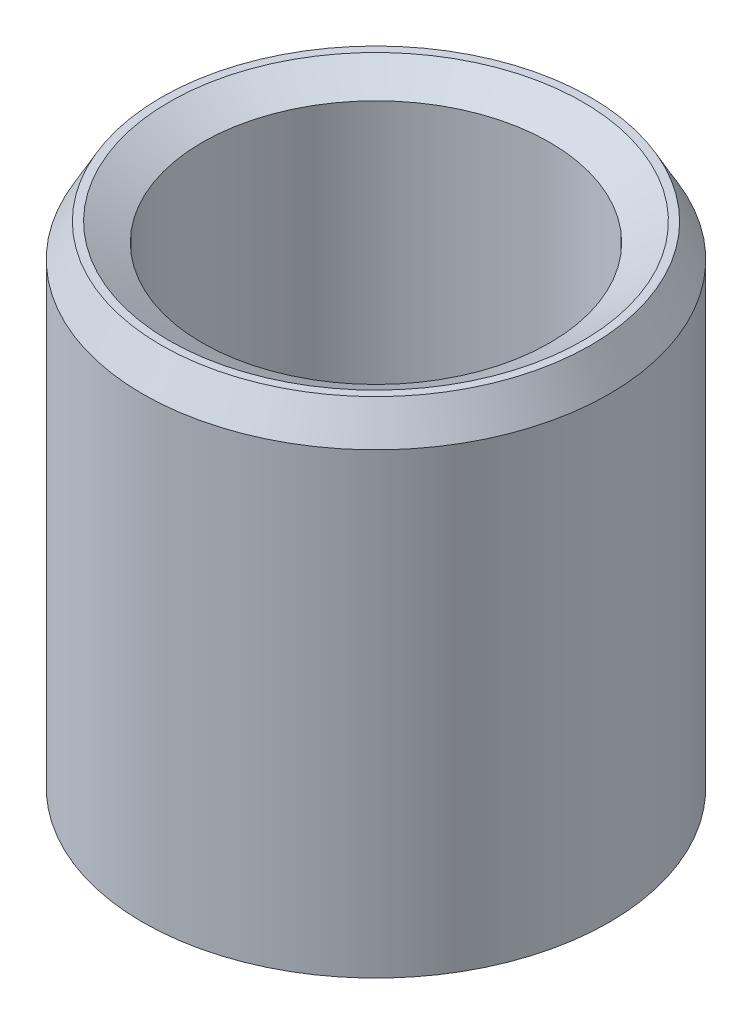
ISO-10303-21;
HEADER;
FILE_DESCRIPTION(('STEP AP214'),'2;1');
FILE_NAME('part.step','',(''),(''),'','','');
FILE_SCHEMA(('AUTOMOTIVE_DESIGN { 1 0 10303 214 1 1 1 1 }'));
ENDSEC;
DATA;
#1=APPLICATION_CONTEXT('core data for automotive mechanical design processes');
#2=APPLICATION_PROTOCOL_DEFINITION('international standard','automotive_design',2000,#1);
#3=PRODUCT_CONTEXT('',#1,'mechanical');
#4=PRODUCT('Part','Part','',(#3));
#5=PRODUCT_RELATED_PRODUCT_CATEGORY('part','',(#4));
#6=PRODUCT_DEFINITION_FORMATION('','',#4);
#7=PRODUCT_DEFINITION_CONTEXT('part definition',#1,'design');
#8=PRODUCT_DEFINITION('design','',#6,#7);
#9=PRODUCT_DEFINITION_SHAPE('','',#8);
#10=(LENGTH_UNIT() NAMED_UNIT(*) SI_UNIT(.MILLI.,.METRE.));
#11=(NAMED_UNIT(*) PLANE_ANGLE_UNIT() SI_UNIT($,.RADIAN.));
#12=(NAMED_UNIT(*) SI_UNIT($,.STERADIAN.) SOLID_ANGLE_UNIT());
#13=UNCERTAINTY_MEASURE_WITH_UNIT(LENGTH_MEASURE(1.E-05),#10,'distance_accuracy_value','');
#14=(GEOMETRIC_REPRESENTATION_CONTEXT(3) GLOBAL_UNCERTAINTY_ASSIGNED_CONTEXT((#13)) GLOBAL_UNIT_ASSIGNED_CONTEXT((#10,
#11,#12)) REPRESENTATION_CONTEXT('',''));
#15=CARTESIAN_POINT('',(0.,0.,0.));
#16=DIRECTION('',(0.,0.,1.));
#17=DIRECTION('',(1.,0.,0.));
#18=AXIS2_PLACEMENT_3D('',#15,#16,#17);
#19=CARTESIAN_POINT('',(0.,49.1159949794759,0.));
#20=DIRECTION('',(0.,-1.,0.));
#21=DIRECTION('',(0.,0.,-1.));
#22=AXIS2_PLACEMENT_3D('',#19,#20,#21);
#23=CYLINDRICAL_SURFACE('',#22,22.5);
#24=CARTESIAN_POINT('',(0.,1.78092800597696,0.));
#25=DIRECTION('',(0.,1.,0.));
#26=DIRECTION('',(0.,0.,1.));
#27=AXIS2_PLACEMENT_3D('',#24,#25,#26);
#28=CIRCLE('',#27,22.5);
#29=CARTESIAN_POINT('',(0.,1.78092800597696,-22.5));
#30=VERTEX_POINT('',#29);
#31=EDGE_CURVE('E10',#30,#30,#28,.T.);
#32=CARTESIAN_POINT('',(0.,45.9272247692056,0.));
#33=DIRECTION('',(0.,1.,0.));
#34=DIRECTION('',(0.,0.,1.));
#35=AXIS2_PLACEMENT_3D('',#32,#33,#34);
#36=CIRCLE('',#35,22.5);
#37=CARTESIAN_POINT('',(0.,45.9272247692056,-22.5));
#38=VERTEX_POINT('',#37);
#39=EDGE_CURVE('E50',#38,#38,#36,.F.);
#40=CARTESIAN_POINT('',(0.,1.78092800597696,-22.5));
#41=CARTESIAN_POINT('',(0.,2.24078526392725,-22.5));
#42=CARTESIAN_POINT('',(0.,2.70064252187755,-22.5));
#43=CARTESIAN_POINT('',(0.,3.62035703777815,-22.5));
#44=CARTESIAN_POINT('',(0.,4.08021429572845,-22.5));
#45=CARTESIAN_POINT('',(0.,4.99992881162905,-22.5));
#46=CARTESIAN_POINT('',(0.,5.45978606957935,-22.5));
#47=CARTESIAN_POINT('',(0.,6.37950058547994,-22.5));
#48=CARTESIAN_POINT('',(0.,6.83935784343024,-22.5));
#49=CARTESIAN_POINT('',(0.,7.75907235933084,-22.5));
#50=CARTESIAN_POINT('',(0.,8.21892961728114,-22.5));
#51=CARTESIAN_POINT('',(0.,9.13864413318174,-22.5));
#52=CARTESIAN_POINT('',(0.,9.59850139113203,-22.5));
#53=CARTESIAN_POINT('',(0.,10.5182159070326,-22.5));
#54=CARTESIAN_POINT('',(0.,10.9780731649829,-22.5));
#55=CARTESIAN_POINT('',(0.,11.8977876808835,-22.5));
#56=CARTESIAN_POINT('',(0.,12.3576449388338,-22.5));
#57=CARTESIAN_POINT('',(0.,13.2773594547344,-22.5));
#58=CARTESIAN_POINT('',(0.,13.7372167126847,-22.5));
#59=CARTESIAN_POINT('',(0.,14.6569312285853,-22.5));
#60=CARTESIAN_POINT('',(0.,15.1167884865356,-22.5));
#61=CARTESIAN_POINT('',(0.,16.0365030024362,-22.5));
#62=CARTESIAN_POINT('',(0.,16.4963602603865,-22.5));
#63=CARTESIAN_POINT('',(0.,17.4160747762871,-22.5));
#64=CARTESIAN_POINT('',(0.,17.8759320342374,-22.5));
#65=CARTESIAN_POINT('',(0.,18.795646550138,-22.5));
#66=CARTESIAN_POINT('',(0.,19.2555038080883,-22.5));
#67=CARTESIAN_POINT('',(0.,20.1752183239889,-22.5));
#68=CARTESIAN_POINT('',(0.,20.6350755819392,-22.5));
#69=CARTESIAN_POINT('',(0.,21.5547900978398,-22.5));
#70=CARTESIAN_POINT('',(0.,22.0146473557901,-22.5));
#71=CARTESIAN_POINT('',(0.,22.9343618716907,-22.5));
#72=CARTESIAN_POINT('',(0.,23.394219129641,-22.5));
#73=CARTESIAN_POINT('',(0.,24.3139336455416,-22.5));
#74=CARTESIAN_POINT('',(0.,24.7737909034919,-22.5));
#75=CARTESIAN_POINT('',(0.,25.6935054193925,-22.5));
#76=CARTESIAN_POINT('',(0.,26.1533626773428,-22.5));
#77=CARTESIAN_POINT('',(0.,27.0730771932434,-22.5));
#78=CARTESIAN_POINT('',(0.,27.5329344511937,-22.5));
#79=CARTESIAN_POINT('',(0.,28.4526489670943,-22.5));
#80=CARTESIAN_POINT('',(0.,28.9125062250446,-22.5));
#81=CARTESIAN_POINT('',(0.,29.8322207409452,-22.5));
#82=CARTESIAN_POINT('',(0.,30.2920779988955,-22.5));
#83=CARTESIAN_POINT('',(0.,31.2117925147961,-22.5));
#84=CARTESIAN_POINT('',(0.,31.6716497727464,-22.5));
#85=CARTESIAN_POINT('',(0.,32.591364288647,-22.5));
#86=CARTESIAN_POINT('',(0.,33.0512215465973,-22.5));
#87=CARTESIAN_POINT('',(0.,33.9709360624979,-22.5));
#88=CARTESIAN_POINT('',(0.,34.4307933204482,-22.5));
#89=CARTESIAN_POINT('',(0.,35.3505078363488,-22.5));
#90=CARTESIAN_POINT('',(0.,35.8103650942991,-22.5));
#91=CARTESIAN_POINT('',(0.,36.7300796101997,-22.5));
#92=CARTESIAN_POINT('',(0.,37.18993686815,-22.5));
#93=CARTESIAN_POINT('',(0.,38.1096513840506,-22.5));
#94=CARTESIAN_POINT('',(0.,38.5695086420008,-22.5));
#95=CARTESIAN_POINT('',(0.,39.4892231579014,-22.5));
#96=CARTESIAN_POINT('',(0.,39.9490804158517,-22.5));
#97=CARTESIAN_POINT('',(0.,40.8687949317523,-22.5));
#98=CARTESIAN_POINT('',(0.,41.3286521897026,-22.5));
#99=CARTESIAN_POINT('',(0.,42.2483667056032,-22.5));
#100=CARTESIAN_POINT('',(0.,42.7082239635535,-22.5));
#101=CARTESIAN_POINT('',(0.,43.6279384794541,-22.5));
#102=CARTESIAN_POINT('',(0.,44.0877957374044,-22.5));
#103=CARTESIAN_POINT('',(0.,45.007510253305,-22.5));
#104=CARTESIAN_POINT('',(0.,45.4673675112553,-22.5));
#105=CARTESIAN_POINT('',(0.,45.9272247692056,-22.5));
#106=B_SPLINE_CURVE_WITH_KNOTS('',3,(#40,#41,#42,#43,#44,#45,#46,#47,#48,#49,#50,#51,#52,#53,
#54,#55,#56,#57,#58,#59,#60,#61,#62,#63,#64,#65,#66,#67,#68,#69,#70,#71,#72,#73,#74,#75,#76,#77,
#78,#79,#80,#81,#82,#83,#84,#85,#86,#87,#88,#89,#90,#91,#92,#93,#94,#95,#96,#97,#98,#99,#100,
#101,#102,#103,#104,#105),.UNSPECIFIED.,.F.,.F.,(4,2,2,2,2,2,2,2,2,2,2,2,2,2,2,2,2,2,2,2,2,2,2,
2,2,2,2,2,2,2,2,2,4),(0.,1.3795717738509,2.75914354770179,4.13871532155269,5.51828709540358,
6.89785886925448,8.27743064310538,9.65700241695627,11.0365741908072,12.4161459646581,
13.795717738509,15.1752895123599,16.5548612862108,17.9344330600617,19.3140048339125,
20.6935766077634,22.0731483816143,23.4527201554652,24.8322919293161,26.211863703167,
27.5914354770179,28.9710072508688,30.3505790247197,31.7301507985706,33.1097225724215,
34.4892943462724,35.8688661201233,37.2484378939742,38.6280096678251,40.007581441676,
41.3871532155269,42.7667249893778,44.1462967632287),.UNSPECIFIED.);
#107=EDGE_CURVE('BSEAM39',#30,#38,#106,.T.);
#108=ORIENTED_EDGE('',*,*,#31,.T.);
#109=ORIENTED_EDGE('',*,*,#39,.T.);
#110=ORIENTED_EDGE('',*,*,#107,.T.);
#111=ORIENTED_EDGE('',*,*,#107,.F.);
#112=EDGE_LOOP('',(#108,#110,#109,#111));
#113=FACE_BOUND('',#112,.T.);
#114=ADVANCED_FACE('F39',(#113),#23,.T.);
#115=CARTESIAN_POINT('',(0.,49.1159949794759,0.));
#116=DIRECTION('',(0.,1.,0.));
#117=DIRECTION('',(0.,0.,1.));
#118=AXIS2_PLACEMENT_3D('',#115,#116,#117);
#119=PLANE('',#118);
#120=CARTESIAN_POINT('',(0.,49.1159949794759,0.));
#121=DIRECTION('',(0.,1.,0.));
#122=DIRECTION('',(0.,0.,1.));
#123=AXIS2_PLACEMENT_3D('',#120,#121,#122);
#124=CIRCLE('',#123,19.9529926628721);
#125=CARTESIAN_POINT('',(0.,49.1159949794759,19.9529926628721));
#126=VERTEX_POINT('',#125);
#127=EDGE_CURVE('E58',#126,#126,#124,.F.);
#128=ORIENTED_EDGE('',*,*,#127,.T.);
#129=EDGE_LOOP('',(#128));
#130=FACE_BOUND('',#129,.T.);
#131=CARTESIAN_POINT('',(0.,49.1159949794759,0.));
#132=DIRECTION('',(0.,1.,0.));
#133=DIRECTION('',(0.,0.,1.));
#134=AXIS2_PLACEMENT_3D('',#131,#132,#133);
#135=CIRCLE('',#134,20.7190719940231);
#136=CARTESIAN_POINT('',(0.,49.1159949794759,-20.7190719940231));
#137=VERTEX_POINT('',#136);
#138=EDGE_CURVE('E61',#137,#137,#135,.T.);
#139=ORIENTED_EDGE('',*,*,#138,.T.);
#140=EDGE_LOOP('',(#139));
#141=FACE_BOUND('',#140,.T.);
#142=ADVANCED_FACE('F88',(#130,#141),#119,.T.);
#143=CARTESIAN_POINT('',(0.,0.,0.));
#144=DIRECTION('',(0.,1.,0.));
#145=DIRECTION('',(0.,0.,1.));
#146=AXIS2_PLACEMENT_3D('',#143,#144,#145);
#147=PLANE('',#146);
#148=CARTESIAN_POINT('',(0.,0.,0.));
#149=DIRECTION('',(0.,1.,0.));
#150=DIRECTION('',(0.,0.,1.));
#151=AXIS2_PLACEMENT_3D('',#148,#149,#150);
#152=CIRCLE('',#151,18.5451504585787);
#153=CARTESIAN_POINT('',(0.,0.,-18.5451504585787));
#154=VERTEX_POINT('',#153);
#155=EDGE_CURVE('E51',#154,#154,#152,.T.);
#156=ORIENTED_EDGE('',*,*,#155,.T.);
#157=EDGE_LOOP('',(#156));
#158=FACE_BOUND('',#157,.T.);
#159=CARTESIAN_POINT('',(0.,0.,0.));
#160=DIRECTION('',(0.,1.,0.));
#161=DIRECTION('',(0.,0.,1.));
#162=AXIS2_PLACEMENT_3D('',#159,#160,#161);
#163=CIRCLE('',#162,19.3112297897297);
#164=CARTESIAN_POINT('',(0.,0.,19.3112297897297));
#165=VERTEX_POINT('',#164);
#166=EDGE_CURVE('E54',#165,#165,#163,.F.);
#167=ORIENTED_EDGE('',*,*,#166,.T.);
#168=EDGE_LOOP('',(#167));
#169=FACE_BOUND('',#168,.T.);
#170=ADVANCED_FACE('F83',(#158,#169),#147,.F.);
#171=CARTESIAN_POINT('',(0.,49.1159949794759,0.));
#172=DIRECTION('',(0.,-1.,0.));
#173=DIRECTION('',(0.,0.,-1.));
#174=AXIS2_PLACEMENT_3D('',#171,#172,#173);
#175=CYLINDRICAL_SURFACE('',#174,16.7642224526018);
#176=CARTESIAN_POINT('',(0.,47.335066973499,0.));
#177=DIRECTION('',(0.,1.,0.));
#178=DIRECTION('',(0.,0.,1.));
#179=AXIS2_PLACEMENT_3D('',#176,#177,#178);
#180=CIRCLE('',#179,16.7642224526018);
#181=CARTESIAN_POINT('',(0.,47.335066973499,16.7642224526018));
#182=VERTEX_POINT('',#181);
#183=EDGE_CURVE('E67',#182,#182,#180,.T.);
#184=ORIENTED_EDGE('',*,*,#183,.T.);
#185=EDGE_LOOP('',(#184));
#186=FACE_BOUND('',#185,.T.);
#187=CARTESIAN_POINT('',(0.,3.1887702102703,0.));
#188=DIRECTION('',(0.,1.,0.));
#189=DIRECTION('',(0.,0.,1.));
#190=AXIS2_PLACEMENT_3D('',#187,#188,#189);
#191=CIRCLE('',#190,16.7642224526018);
#192=CARTESIAN_POINT('',(0.,3.1887702102703,-16.7642224526018));
#193=VERTEX_POINT('',#192);
#194=EDGE_CURVE('E69',#193,#193,#191,.F.);
#195=ORIENTED_EDGE('',*,*,#194,.T.);
#196=EDGE_LOOP('',(#195));
#197=FACE_BOUND('',#196,.T.);
#198=ADVANCED_FACE('F71',(#186,#197),#175,.F.);
#199=CARTESIAN_POINT('',(0.,47.335066973499,0.));
#200=DIRECTION('',(0.,1.,0.));
#201=DIRECTION('',(0.,0.,1.));
#202=AXIS2_PLACEMENT_3D('',#199,#200,#201);
#203=CONICAL_SURFACE('',#202,16.7642224526018,1.06145067257378);
#204=ORIENTED_EDGE('',*,*,#127,.F.);
#205=EDGE_LOOP('',(#204));
#206=FACE_BOUND('',#205,.T.);
#207=ORIENTED_EDGE('',*,*,#183,.F.);
#208=EDGE_LOOP('',(#207));
#209=FACE_BOUND('',#208,.T.);
#210=ADVANCED_FACE('F77',(#206,#209),#203,.F.);
#211=CARTESIAN_POINT('',(0.,0.,0.));
#212=DIRECTION('',(0.,-1.,0.));
#213=DIRECTION('',(0.,0.,-1.));
#214=AXIS2_PLACEMENT_3D('',#211,#212,#213);
#215=CONICAL_SURFACE('',#214,18.5451504585787,0.509345654221112);
#216=CARTESIAN_POINT('',(0.,3.1887702102703,-16.7642224526018));
#217=CARTESIAN_POINT('',(0.,3.15555385391332,-16.7827737859974));
#218=CARTESIAN_POINT('',(0.,3.12233749755634,-16.801325119393));
#219=CARTESIAN_POINT('',(0.,3.05590478484237,-16.8384277861842));
#220=CARTESIAN_POINT('',(0.,3.02268842848539,-16.8569791195798));
#221=CARTESIAN_POINT('',(0.,2.95625571577143,-16.8940817863709));
#222=CARTESIAN_POINT('',(0.,2.92303935941444,-16.9126331197665));
#223=CARTESIAN_POINT('',(0.,2.85660664670048,-16.9497357865577));
#224=CARTESIAN_POINT('',(0.,2.8233902903435,-16.9682871199533));
#225=CARTESIAN_POINT('',(0.,2.75695757762953,-17.0053897867445));
#226=CARTESIAN_POINT('',(0.,2.72374122127255,-17.0239411201401));
#227=CARTESIAN_POINT('',(0.,2.65730850855858,-17.0610437869313));
#228=CARTESIAN_POINT('',(0.,2.6240921522016,-17.0795951203269));
#229=CARTESIAN_POINT('',(0.,2.55765943948764,-17.1166977871181));
#230=CARTESIAN_POINT('',(0.,2.52444308313066,-17.1352491205137));
#231=CARTESIAN_POINT('',(0.,2.45801037041669,-17.1723517873048));
#232=CARTESIAN_POINT('',(0.,2.42479401405971,-17.1909031207004));
#233=CARTESIAN_POINT('',(0.,2.35836130134574,-17.2280057874916));
#234=CARTESIAN_POINT('',(0.,2.32514494498876,-17.2465571208872));
#235=CARTESIAN_POINT('',(0.,2.2587122322748,-17.2836597876784));
#236=CARTESIAN_POINT('',(0.,2.22549587591781,-17.302211121074));
#237=CARTESIAN_POINT('',(0.,2.15906316320385,-17.3393137878652));
#238=CARTESIAN_POINT('',(0.,2.12584680684687,-17.3578651212608));
#239=CARTESIAN_POINT('',(0.,2.0594140941329,-17.394967788052));
#240=CARTESIAN_POINT('',(0.,2.02619773777592,-17.4135191214476));
#241=CARTESIAN_POINT('',(0.,1.95976502506196,-17.4506217882387));
#242=CARTESIAN_POINT('',(0.,1.92654866870497,-17.4691731216343));
#243=CARTESIAN_POINT('',(0.,1.86011595599101,-17.5062757884255));
#244=CARTESIAN_POINT('',(0.,1.82689959963403,-17.5248271218211));
#245=CARTESIAN_POINT('',(0.,1.76046688692006,-17.5619297886123));
#246=CARTESIAN_POINT('',(0.,1.72725053056308,-17.5804811220079));
#247=CARTESIAN_POINT('',(0.,1.66081781784912,-17.6175837887991));
#248=CARTESIAN_POINT('',(0.,1.62760146149213,-17.6361351221947));
#249=CARTESIAN_POINT('',(0.,1.56116874877817,-17.6732377889859));
#250=CARTESIAN_POINT('',(0.,1.52795239242119,-17.6917891223815));
#251=CARTESIAN_POINT('',(0.,1.46151967970722,-17.7288917891726));
#252=CARTESIAN_POINT('',(0.,1.42830332335024,-17.7474431225682));
#253=CARTESIAN_POINT('',(0.,1.36187061063627,-17.7845457893594));
#254=CARTESIAN_POINT('',(0.,1.32865425427929,-17.803097122755));
#255=CARTESIAN_POINT('',(0.,1.26222154156533,-17.8401997895462));
#256=CARTESIAN_POINT('',(0.,1.22900518520835,-17.8587511229418));
#257=CARTESIAN_POINT('',(0.,1.16257247249438,-17.895853789733));
#258=CARTESIAN_POINT('',(0.,1.1293561161374,-17.9144051231286));
#259=CARTESIAN_POINT('',(0.,1.06292340342343,-17.9515077899198));
#260=CARTESIAN_POINT('',(0.,1.02970704706645,-17.9700591233153));
#261=CARTESIAN_POINT('',(0.,0.963274334352487,-18.0071617901065));
#262=CARTESIAN_POINT('',(0.,0.930057977995505,-18.0257131235021));
#263=CARTESIAN_POINT('',(0.,0.86362526528154,-18.0628157902933));
#264=CARTESIAN_POINT('',(0.,0.830408908924558,-18.0813671236889));
#265=CARTESIAN_POINT('',(0.,0.763976196210593,-18.1184697904801));
#266=CARTESIAN_POINT('',(0.,0.73075983985361,-18.1370211238757));
#267=CARTESIAN_POINT('',(0.,0.664327127139646,-18.1741237906669));
#268=CARTESIAN_POINT('',(0.,0.631110770782664,-18.1926751240625));
#269=CARTESIAN_POINT('',(0.,0.564678058068699,-18.2297777908537));
#270=CARTESIAN_POINT('',(0.,0.531461701711717,-18.2483291242492));
#271=CARTESIAN_POINT('',(0.,0.465028988997752,-18.2854317910404));
#272=CARTESIAN_POINT('',(0.,0.43181263264077,-18.303983124436));
#273=CARTESIAN_POINT('',(0.,0.365379919926805,-18.3410857912272));
#274=CARTESIAN_POINT('',(0.,0.332163563569823,-18.3596371246228));
#275=CARTESIAN_POINT('',(0.,0.265730850855858,-18.396739791414));
#276=CARTESIAN_POINT('',(0.,0.232514494498876,-18.4152911248096));
#277=CARTESIAN_POINT('',(0.,0.166081781784912,-18.4523937916008));
#278=CARTESIAN_POINT('',(0.,0.132865425427929,-18.4709451249964));
#279=CARTESIAN_POINT('',(0.,0.0664327127139648,-18.5080477917876));
#280=CARTESIAN_POINT('',(0.,0.0332163563569824,-18.5265991251831));
#281=CARTESIAN_POINT('',(0.,0.,-18.5451504585787));
#282=B_SPLINE_CURVE_WITH_KNOTS('',3,(#216,#217,#218,#219,#220,#221,#222,#223,#224,#225,#226,
#227,#228,#229,#230,#231,#232,#233,#234,#235,#236,#237,#238,#239,#240,#241,#242,#243,#244,#245,
#246,#247,#248,#249,#250,#251,#252,#253,#254,#255,#256,#257,#258,#259,#260,#261,#262,#263,#264,
#265,#266,#267,#268,#269,#270,#271,#272,#273,#274,#275,#276,#277,#278,#279,#280,#281),
.UNSPECIFIED.,.F.,.F.,(4,2,2,2,2,2,2,2,2,2,2,2,2,2,2,2,2,2,2,2,2,2,2,2,2,2,2,2,2,2,2,2,4),(0.,
0.114137218747858,0.228274437495717,0.342411656243575,0.456548874991433,0.570686093739291,
0.684823312487148,0.798960531235006,0.913097749982864,1.02723496873072,1.14137218747858,
1.25550940622644,1.3696466249743,1.48378384372216,1.59792106247001,1.71205828121787,
1.82619549996573,1.94033271871359,2.05446993746144,2.1686071562093,2.28274437495716,
2.39688159370502,2.51101881245288,2.62515603120074,2.73929324994859,2.85343046869645,
2.96756768744431,3.08170490619217,3.19584212494003,3.30997934368788,3.42411656243574,
3.5382537811836,3.65239099993146),.UNSPECIFIED.);
#283=EDGE_CURVE('BSEAM73',#193,#154,#282,.T.);
#284=ORIENTED_EDGE('',*,*,#194,.F.);
#285=ORIENTED_EDGE('',*,*,#155,.F.);
#286=ORIENTED_EDGE('',*,*,#283,.T.);
#287=ORIENTED_EDGE('',*,*,#283,.F.);
#288=EDGE_LOOP('',(#284,#286,#285,#287));
#289=FACE_BOUND('',#288,.T.);
#290=ADVANCED_FACE('F73',(#289),#215,.F.);
#291=CARTESIAN_POINT('',(0.,1.78092800597696,0.));
#292=DIRECTION('',(0.,1.,0.));
#293=DIRECTION('',(0.,0.,1.));
#294=AXIS2_PLACEMENT_3D('',#291,#292,#293);
#295=CONICAL_SURFACE('',#294,22.5,1.06145067257378);
#296=ORIENTED_EDGE('',*,*,#166,.F.);
#297=EDGE_LOOP('',(#296));
#298=FACE_BOUND('',#297,.T.);
#299=ORIENTED_EDGE('',*,*,#31,.F.);
#300=EDGE_LOOP('',(#299));
#301=FACE_BOUND('',#300,.T.);
#302=ADVANCED_FACE('F76',(#298,#301),#295,.T.);
#303=CARTESIAN_POINT('',(0.,49.1159949794759,0.));
#304=DIRECTION('',(0.,-1.,0.));
#305=DIRECTION('',(0.,0.,-1.));
#306=AXIS2_PLACEMENT_3D('',#303,#304,#305);
#307=CONICAL_SURFACE('',#306,20.7190719940231,0.509345654221112);
#308=CARTESIAN_POINT('',(0.,45.9272247692056,-22.5));
#309=CARTESIAN_POINT('',(0.,45.9604411255626,-22.4814486666044));
#310=CARTESIAN_POINT('',(0.,45.9936574819196,-22.4628973332088));
#311=CARTESIAN_POINT('',(0.,46.0600901946336,-22.4257946664176));
#312=CARTESIAN_POINT('',(0.,46.0933065509905,-22.407243333022));
#313=CARTESIAN_POINT('',(0.,46.1597392637045,-22.3701406662309));
#314=CARTESIAN_POINT('',(0.,46.1929556200615,-22.3515893328353));
#315=CARTESIAN_POINT('',(0.,46.2593883327755,-22.3144866660441));
#316=CARTESIAN_POINT('',(0.,46.2926046891324,-22.2959353326485));
#317=CARTESIAN_POINT('',(0.,46.3590374018464,-22.2588326658573));
#318=CARTESIAN_POINT('',(0.,46.3922537582034,-22.2402813324617));
#319=CARTESIAN_POINT('',(0.,46.4586864709173,-22.2031786656705));
#320=CARTESIAN_POINT('',(0.,46.4919028272743,-22.1846273322749));
#321=CARTESIAN_POINT('',(0.,46.5583355399883,-22.1475246654837));
#322=CARTESIAN_POINT('',(0.,46.5915518963453,-22.1289733320881));
#323=CARTESIAN_POINT('',(0.,46.6579846090592,-22.091870665297));
#324=CARTESIAN_POINT('',(0.,46.6912009654162,-22.0733193319014));
#325=CARTESIAN_POINT('',(0.,46.7576336781302,-22.0362166651102));
#326=CARTESIAN_POINT('',(0.,46.7908500344872,-22.0176653317146));
#327=CARTESIAN_POINT('',(0.,46.8572827472011,-21.9805626649234));
#328=CARTESIAN_POINT('',(0.,46.8904991035581,-21.9620113315278));
#329=CARTESIAN_POINT('',(0.,46.9569318162721,-21.9249086647366));
#330=CARTESIAN_POINT('',(0.,46.9901481726291,-21.906357331341));
#331=CARTESIAN_POINT('',(0.,47.056580885343,-21.8692546645498));
#332=CARTESIAN_POINT('',(0.,47.0897972417,-21.8507033311542));
#333=CARTESIAN_POINT('',(0.,47.156229954414,-21.8136006643631));
#334=CARTESIAN_POINT('',(0.,47.189446310771,-21.7950493309675));
#335=CARTESIAN_POINT('',(0.,47.2558790234849,-21.7579466641763));
#336=CARTESIAN_POINT('',(0.,47.2890953798419,-21.7393953307807));
#337=CARTESIAN_POINT('',(0.,47.3555280925559,-21.7022926639895));
#338=CARTESIAN_POINT('',(0.,47.3887444489129,-21.6837413305939));
#339=CARTESIAN_POINT('',(0.,47.4551771616268,-21.6466386638027));
#340=CARTESIAN_POINT('',(0.,47.4883935179838,-21.6280873304071));
#341=CARTESIAN_POINT('',(0.,47.5548262306978,-21.5909846636159));
#342=CARTESIAN_POINT('',(0.,47.5880425870548,-21.5724333302203));
#343=CARTESIAN_POINT('',(0.,47.6544752997687,-21.5353306634292));
#344=CARTESIAN_POINT('',(0.,47.6876916561257,-21.5167793300336));
#345=CARTESIAN_POINT('',(0.,47.7541243688397,-21.4796766632424));
#346=CARTESIAN_POINT('',(0.,47.7873407251966,-21.4611253298468));
#347=CARTESIAN_POINT('',(0.,47.8537734379106,-21.4240226630556));
#348=CARTESIAN_POINT('',(0.,47.8869897942676,-21.40547132966));
#349=CARTESIAN_POINT('',(0.,47.9534225069815,-21.3683686628688));
#350=CARTESIAN_POINT('',(0.,47.9866388633385,-21.3498173294732));
#351=CARTESIAN_POINT('',(0.,48.0530715760525,-21.312714662682));
#352=CARTESIAN_POINT('',(0.,48.0862879324095,-21.2941633292864));
#353=CARTESIAN_POINT('',(0.,48.1527206451234,-21.2570606624953));
#354=CARTESIAN_POINT('',(0.,48.1859370014804,-21.2385093290997));
#355=CARTESIAN_POINT('',(0.,48.2523697141944,-21.2014066623085));
#356=CARTESIAN_POINT('',(0.,48.2855860705514,-21.1828553289129));
#357=CARTESIAN_POINT('',(0.,48.3520187832653,-21.1457526621217));
#358=CARTESIAN_POINT('',(0.,48.3852351396223,-21.1272013287261));
#359=CARTESIAN_POINT('',(0.,48.4516678523363,-21.0900986619349));
#360=CARTESIAN_POINT('',(0.,48.4848842086933,-21.0715473285393));
#361=CARTESIAN_POINT('',(0.,48.5513169214072,-21.0344446617481));
#362=CARTESIAN_POINT('',(0.,48.5845332777642,-21.0158933283525));
#363=CARTESIAN_POINT('',(0.,48.6509659904782,-20.9787906615614));
#364=CARTESIAN_POINT('',(0.,48.6841823468352,-20.9602393281658));
#365=CARTESIAN_POINT('',(0.,48.7506150595491,-20.9231366613746));
#366=CARTESIAN_POINT('',(0.,48.7838314159061,-20.904585327979));
#367=CARTESIAN_POINT('',(0.,48.8502641286201,-20.8674826611878));
#368=CARTESIAN_POINT('',(0.,48.8834804849771,-20.8489313277922));
#369=CARTESIAN_POINT('',(0.,48.949913197691,-20.811828661001));
#370=CARTESIAN_POINT('',(0.,48.983129554048,-20.7932773276054));
#371=CARTESIAN_POINT('',(0.,49.049562266762,-20.7561746608142));
#372=CARTESIAN_POINT('',(0.,49.082778623119,-20.7376233274186));
#373=CARTESIAN_POINT('',(0.,49.1159949794759,-20.7190719940231));
#374=B_SPLINE_CURVE_WITH_KNOTS('',3,(#308,#309,#310,#311,#312,#313,#314,#315,#316,#317,#318,
#319,#320,#321,#322,#323,#324,#325,#326,#327,#328,#329,#330,#331,#332,#333,#334,#335,#336,#337,
#338,#339,#340,#341,#342,#343,#344,#345,#346,#347,#348,#349,#350,#351,#352,#353,#354,#355,#356,
#357,#358,#359,#360,#361,#362,#363,#364,#365,#366,#367,#368,#369,#370,#371,#372,#373),
.UNSPECIFIED.,.F.,.F.,(4,2,2,2,2,2,2,2,2,2,2,2,2,2,2,2,2,2,2,2,2,2,2,2,2,2,2,2,2,2,2,2,4),(0.,
0.114137218747861,0.228274437495717,0.342411656243578,0.456548874991434,0.570686093739295,
0.684823312487151,0.798960531235012,0.913097749982867,1.02723496873073,1.14137218747858,
1.25550940622645,1.36964662497431,1.48378384372216,1.59792106247002,1.71205828121788,
1.82619549996573,1.9403327187136,2.05446993746145,2.16860715620931,2.28274437495717,
2.39688159370503,2.51101881245289,2.62515603120075,2.73929324994861,2.85343046869647,
2.96756768744433,3.08170490619218,3.19584212494004,3.3099793436879,3.42411656243576,
3.53825378118362,3.65239099993148),.UNSPECIFIED.);
#375=EDGE_CURVE('BSEAM45',#38,#137,#374,.T.);
#376=ORIENTED_EDGE('',*,*,#39,.F.);
#377=ORIENTED_EDGE('',*,*,#138,.F.);
#378=ORIENTED_EDGE('',*,*,#375,.T.);
#379=ORIENTED_EDGE('',*,*,#375,.F.);
#380=EDGE_LOOP('',(#376,#378,#377,#379));
#381=FACE_BOUND('',#380,.T.);
#382=ADVANCED_FACE('F45',(#381),#307,.T.);
#383=CLOSED_SHELL('',(#114,#142,#170,#198,#210,#290,#302,#382));
#384=MANIFOLD_SOLID_BREP('B2',#383);
#385=ADVANCED_BREP_SHAPE_REPRESENTATION('',(#18,#384),#14);
#386=SHAPE_DEFINITION_REPRESENTATION(#9,#385);
ENDSEC;
END-ISO-10303-21;
